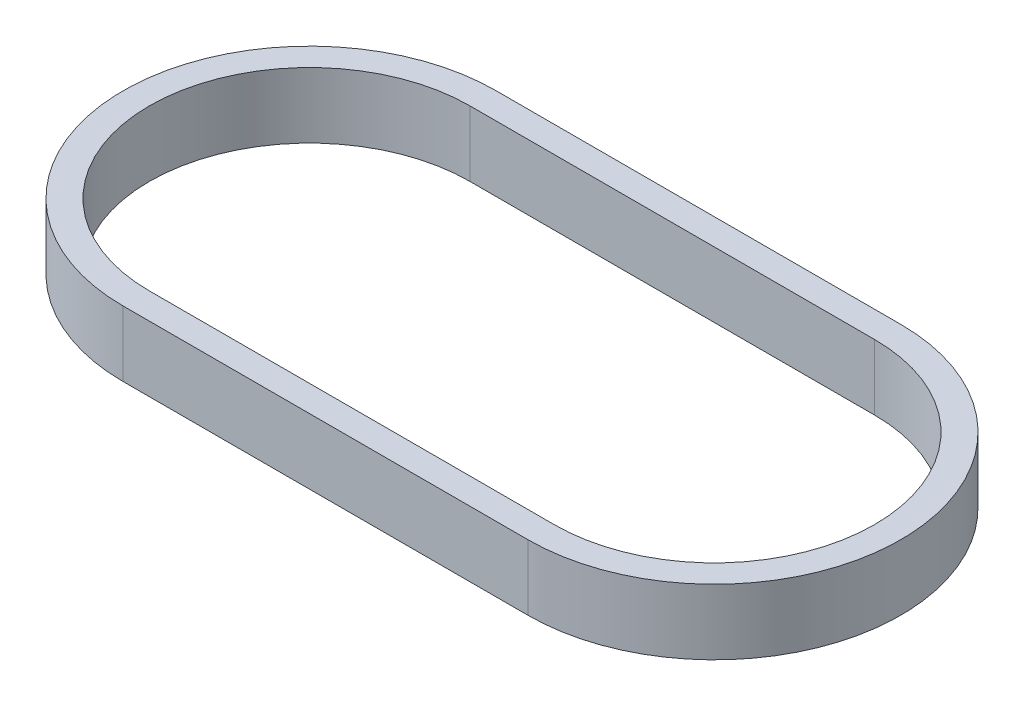
ISO-10303-21;
HEADER;
FILE_DESCRIPTION(('STEP AP214'),'2;1');
FILE_NAME('part.step','',(''),(''),'','','');
FILE_SCHEMA(('AUTOMOTIVE_DESIGN { 1 0 10303 214 1 1 1 1 }'));
ENDSEC;
DATA;
#1=APPLICATION_CONTEXT('core data for automotive mechanical design processes');
#2=APPLICATION_PROTOCOL_DEFINITION('international standard','automotive_design',2000,#1);
#3=PRODUCT_CONTEXT('',#1,'mechanical');
#4=PRODUCT('Part','Part','',(#3));
#5=PRODUCT_RELATED_PRODUCT_CATEGORY('part','',(#4));
#6=PRODUCT_DEFINITION_FORMATION('','',#4);
#7=PRODUCT_DEFINITION_CONTEXT('part definition',#1,'design');
#8=PRODUCT_DEFINITION('design','',#6,#7);
#9=PRODUCT_DEFINITION_SHAPE('','',#8);
#10=(LENGTH_UNIT() NAMED_UNIT(*) SI_UNIT(.MILLI.,.METRE.));
#11=(NAMED_UNIT(*) PLANE_ANGLE_UNIT() SI_UNIT($,.RADIAN.));
#12=(NAMED_UNIT(*) SI_UNIT($,.STERADIAN.) SOLID_ANGLE_UNIT());
#13=UNCERTAINTY_MEASURE_WITH_UNIT(LENGTH_MEASURE(1.E-05),#10,'distance_accuracy_value','');
#14=(GEOMETRIC_REPRESENTATION_CONTEXT(3) GLOBAL_UNCERTAINTY_ASSIGNED_CONTEXT((#13)) GLOBAL_UNIT_ASSIGNED_CONTEXT((#10,
#11,#12)) REPRESENTATION_CONTEXT('',''));
#15=CARTESIAN_POINT('',(0.,0.,0.));
#16=DIRECTION('',(0.,0.,1.));
#17=DIRECTION('',(1.,0.,0.));
#18=AXIS2_PLACEMENT_3D('',#15,#16,#17);
#19=CARTESIAN_POINT('',(0.,12.7,0.));
#20=DIRECTION('',(0.,1.,0.));
#21=DIRECTION('',(0.,0.,1.));
#22=AXIS2_PLACEMENT_3D('',#19,#20,#21);
#23=PLANE('',#22);
#24=CARTESIAN_POINT('',(0.,12.7,0.));
#25=DIRECTION('',(0.,1.,0.));
#26=DIRECTION('',(0.,0.,1.));
#27=AXIS2_PLACEMENT_3D('',#24,#25,#26);
#28=CIRCLE('',#27,36.1721401654458);
#29=CARTESIAN_POINT('',(0.,12.7,-36.1721401654458));
#30=VERTEX_POINT('',#29);
#31=CARTESIAN_POINT('',(0.,12.7,36.1721401654458));
#32=VERTEX_POINT('',#31);
#33=EDGE_CURVE('E137',#30,#32,#28,.T.);
#34=ORIENTED_EDGE('',*,*,#33,.T.);
#35=DIRECTION('',(1.,0.,0.));
#36=VECTOR('',#35,1.);
#37=CARTESIAN_POINT('',(0.,12.7,36.1721401654458));
#38=LINE('',#37,#36);
#39=CARTESIAN_POINT('',(78.5207480370886,12.7,36.1721401654459));
#40=VERTEX_POINT('',#39);
#41=EDGE_CURVE('E140',#32,#40,#38,.T.);
#42=ORIENTED_EDGE('',*,*,#41,.T.);
#43=CARTESIAN_POINT('',(78.5207480370886,12.7,1.04055238728977E-13));
#44=DIRECTION('',(0.,1.,0.));
#45=DIRECTION('',(0.,0.,1.));
#46=AXIS2_PLACEMENT_3D('',#43,#44,#45);
#47=CIRCLE('',#46,36.1721401654458);
#48=CARTESIAN_POINT('',(78.5207480370886,12.7,-36.1721401654458));
#49=VERTEX_POINT('',#48);
#50=EDGE_CURVE('E144',#40,#49,#47,.T.);
#51=ORIENTED_EDGE('',*,*,#50,.T.);
#52=DIRECTION('',(-1.,0.,0.));
#53=VECTOR('',#52,1.);
#54=CARTESIAN_POINT('',(0.,12.7,-36.1721401654458));
#55=LINE('',#54,#53);
#56=EDGE_CURVE('E146',#49,#30,#55,.T.);
#57=ORIENTED_EDGE('',*,*,#56,.T.);
#58=EDGE_LOOP('',(#34,#42,#51,#57));
#59=FACE_BOUND('',#58,.T.);
#60=DIRECTION('',(1.,0.,0.));
#61=VECTOR('',#60,1.);
#62=CARTESIAN_POINT('',(0.,12.7,31.0921401654458));
#63=LINE('',#62,#61);
#64=CARTESIAN_POINT('',(0.,12.7,31.0921401654458));
#65=VERTEX_POINT('',#64);
#66=CARTESIAN_POINT('',(78.5207480370886,12.7,31.0921401654459));
#67=VERTEX_POINT('',#66);
#68=EDGE_CURVE('E108',#65,#67,#63,.T.);
#69=ORIENTED_EDGE('',*,*,#68,.F.);
#70=CARTESIAN_POINT('',(0.,12.7,0.));
#71=DIRECTION('',(0.,1.,0.));
#72=DIRECTION('',(0.,0.,1.));
#73=AXIS2_PLACEMENT_3D('',#70,#71,#72);
#74=CIRCLE('',#73,31.0921401654458);
#75=CARTESIAN_POINT('',(0.,12.7,-31.0921401654458));
#76=VERTEX_POINT('',#75);
#77=EDGE_CURVE('E100',#76,#65,#74,.T.);
#78=ORIENTED_EDGE('',*,*,#77,.F.);
#79=DIRECTION('',(-1.,0.,0.));
#80=VECTOR('',#79,1.);
#81=CARTESIAN_POINT('',(0.,12.7,-31.0921401654458));
#82=LINE('',#81,#80);
#83=CARTESIAN_POINT('',(78.5207480370886,12.7,-31.0921401654458));
#84=VERTEX_POINT('',#83);
#85=EDGE_CURVE('E122',#84,#76,#82,.T.);
#86=ORIENTED_EDGE('',*,*,#85,.F.);
#87=CARTESIAN_POINT('',(78.5207480370886,12.7,1.04055238728977E-13));
#88=DIRECTION('',(0.,1.,0.));
#89=DIRECTION('',(0.,0.,1.));
#90=AXIS2_PLACEMENT_3D('',#87,#88,#89);
#91=CIRCLE('',#90,31.0921401654458);
#92=EDGE_CURVE('E120',#67,#84,#91,.T.);
#93=ORIENTED_EDGE('',*,*,#92,.F.);
#94=EDGE_LOOP('',(#69,#78,#86,#93));
#95=FACE_BOUND('',#94,.T.);
#96=ADVANCED_FACE('F35',(#59,#95),#23,.T.);
#97=CARTESIAN_POINT('',(0.,0.,0.));
#98=DIRECTION('',(0.,1.,0.));
#99=DIRECTION('',(0.,0.,1.));
#100=AXIS2_PLACEMENT_3D('',#97,#98,#99);
#101=PLANE('',#100);
#102=CARTESIAN_POINT('',(0.,0.,0.));
#103=DIRECTION('',(0.,1.,0.));
#104=DIRECTION('',(0.,0.,1.));
#105=AXIS2_PLACEMENT_3D('',#102,#103,#104);
#106=CIRCLE('',#105,36.1721401654458);
#107=CARTESIAN_POINT('',(0.,0.,-36.1721401654458));
#108=VERTEX_POINT('',#107);
#109=CARTESIAN_POINT('',(0.,0.,36.1721401654458));
#110=VERTEX_POINT('',#109);
#111=EDGE_CURVE('E116',#108,#110,#106,.T.);
#112=ORIENTED_EDGE('',*,*,#111,.F.);
#113=DIRECTION('',(-1.,0.,0.));
#114=VECTOR('',#113,1.);
#115=CARTESIAN_POINT('',(0.,0.,-36.1721401654458));
#116=LINE('',#115,#114);
#117=CARTESIAN_POINT('',(78.5207480370886,0.,-36.1721401654458));
#118=VERTEX_POINT('',#117);
#119=EDGE_CURVE('E141',#118,#108,#116,.T.);
#120=ORIENTED_EDGE('',*,*,#119,.F.);
#121=CARTESIAN_POINT('',(78.5207480370886,0.,1.04055238728977E-13));
#122=DIRECTION('',(0.,1.,0.));
#123=DIRECTION('',(0.,0.,1.));
#124=AXIS2_PLACEMENT_3D('',#121,#122,#123);
#125=CIRCLE('',#124,36.1721401654458);
#126=CARTESIAN_POINT('',(78.5207480370886,0.,36.1721401654459));
#127=VERTEX_POINT('',#126);
#128=EDGE_CURVE('E154',#127,#118,#125,.T.);
#129=ORIENTED_EDGE('',*,*,#128,.F.);
#130=DIRECTION('',(1.,0.,0.));
#131=VECTOR('',#130,1.);
#132=CARTESIAN_POINT('',(0.,0.,36.1721401654458));
#133=LINE('',#132,#131);
#134=EDGE_CURVE('E151',#110,#127,#133,.T.);
#135=ORIENTED_EDGE('',*,*,#134,.F.);
#136=EDGE_LOOP('',(#112,#120,#129,#135));
#137=FACE_BOUND('',#136,.T.);
#138=CARTESIAN_POINT('',(0.,0.,0.));
#139=DIRECTION('',(0.,1.,0.));
#140=DIRECTION('',(0.,0.,1.));
#141=AXIS2_PLACEMENT_3D('',#138,#139,#140);
#142=CIRCLE('',#141,31.0921401654458);
#143=CARTESIAN_POINT('',(0.,0.,-31.0921401654458));
#144=VERTEX_POINT('',#143);
#145=CARTESIAN_POINT('',(0.,0.,31.0921401654458));
#146=VERTEX_POINT('',#145);
#147=EDGE_CURVE('E58',#144,#146,#142,.T.);
#148=ORIENTED_EDGE('',*,*,#147,.T.);
#149=DIRECTION('',(1.,0.,0.));
#150=VECTOR('',#149,1.);
#151=CARTESIAN_POINT('',(0.,0.,31.0921401654458));
#152=LINE('',#151,#150);
#153=CARTESIAN_POINT('',(78.5207480370886,0.,31.0921401654459));
#154=VERTEX_POINT('',#153);
#155=EDGE_CURVE('E115',#146,#154,#152,.T.);
#156=ORIENTED_EDGE('',*,*,#155,.T.);
#157=CARTESIAN_POINT('',(78.5207480370886,0.,1.04055238728977E-13));
#158=DIRECTION('',(0.,1.,0.));
#159=DIRECTION('',(0.,0.,1.));
#160=AXIS2_PLACEMENT_3D('',#157,#158,#159);
#161=CIRCLE('',#160,31.0921401654458);
#162=CARTESIAN_POINT('',(78.5207480370886,0.,-31.0921401654458));
#163=VERTEX_POINT('',#162);
#164=EDGE_CURVE('E129',#154,#163,#161,.T.);
#165=ORIENTED_EDGE('',*,*,#164,.T.);
#166=DIRECTION('',(-1.,0.,0.));
#167=VECTOR('',#166,1.);
#168=CARTESIAN_POINT('',(0.,0.,-31.0921401654458));
#169=LINE('',#168,#167);
#170=EDGE_CURVE('E109',#163,#144,#169,.T.);
#171=ORIENTED_EDGE('',*,*,#170,.T.);
#172=EDGE_LOOP('',(#148,#156,#165,#171));
#173=FACE_BOUND('',#172,.T.);
#174=ADVANCED_FACE('F172',(#137,#173),#101,.F.);
#175=CARTESIAN_POINT('',(0.,12.7,0.));
#176=DIRECTION('',(0.,-1.,0.));
#177=DIRECTION('',(0.,0.,-1.));
#178=AXIS2_PLACEMENT_3D('',#175,#176,#177);
#179=CYLINDRICAL_SURFACE('',#178,36.1721401654458);
#180=ORIENTED_EDGE('',*,*,#111,.T.);
#181=DIRECTION('',(0.,-1.,0.));
#182=VECTOR('',#181,1.);
#183=CARTESIAN_POINT('',(0.,12.7,36.1721401654458));
#184=LINE('',#183,#182);
#185=EDGE_CURVE('E11',#32,#110,#184,.T.);
#186=ORIENTED_EDGE('',*,*,#185,.F.);
#187=ORIENTED_EDGE('',*,*,#33,.F.);
#188=DIRECTION('',(0.,-1.,0.));
#189=VECTOR('',#188,1.);
#190=CARTESIAN_POINT('',(0.,12.7,-36.1721401654458));
#191=LINE('',#190,#189);
#192=EDGE_CURVE('E148',#30,#108,#191,.T.);
#193=ORIENTED_EDGE('',*,*,#192,.T.);
#194=EDGE_LOOP('',(#180,#186,#187,#193));
#195=FACE_BOUND('',#194,.T.);
#196=ADVANCED_FACE('F37',(#195),#179,.T.);
#197=CARTESIAN_POINT('',(0.,12.7,36.1721401654458));
#198=DIRECTION('',(0.,0.,-1.));
#199=DIRECTION('',(-1.,0.,0.));
#200=AXIS2_PLACEMENT_3D('',#197,#198,#199);
#201=PLANE('',#200);
#202=ORIENTED_EDGE('',*,*,#134,.T.);
#203=DIRECTION('',(0.,-1.,0.));
#204=VECTOR('',#203,1.);
#205=CARTESIAN_POINT('',(78.5207480370886,12.7,36.1721401654459));
#206=LINE('',#205,#204);
#207=EDGE_CURVE('E43',#40,#127,#206,.T.);
#208=ORIENTED_EDGE('',*,*,#207,.F.);
#209=ORIENTED_EDGE('',*,*,#41,.F.);
#210=ORIENTED_EDGE('',*,*,#185,.T.);
#211=EDGE_LOOP('',(#202,#208,#209,#210));
#212=FACE_BOUND('',#211,.T.);
#213=ADVANCED_FACE('F182',(#212),#201,.F.);
#214=CARTESIAN_POINT('',(78.5207480370886,12.7,1.04055238728977E-13));
#215=DIRECTION('',(0.,-1.,0.));
#216=DIRECTION('',(0.,0.,-1.));
#217=AXIS2_PLACEMENT_3D('',#214,#215,#216);
#218=CYLINDRICAL_SURFACE('',#217,36.1721401654458);
#219=ORIENTED_EDGE('',*,*,#128,.T.);
#220=DIRECTION('',(0.,-1.,0.));
#221=VECTOR('',#220,1.);
#222=CARTESIAN_POINT('',(78.5207480370886,12.7,-36.1721401654458));
#223=LINE('',#222,#221);
#224=EDGE_CURVE('E159',#49,#118,#223,.T.);
#225=ORIENTED_EDGE('',*,*,#224,.F.);
#226=ORIENTED_EDGE('',*,*,#50,.F.);
#227=ORIENTED_EDGE('',*,*,#207,.T.);
#228=EDGE_LOOP('',(#219,#225,#226,#227));
#229=FACE_BOUND('',#228,.T.);
#230=ADVANCED_FACE('F166',(#229),#218,.T.);
#231=CARTESIAN_POINT('',(0.,12.7,-36.1721401654458));
#232=DIRECTION('',(0.,0.,1.));
#233=DIRECTION('',(1.,0.,0.));
#234=AXIS2_PLACEMENT_3D('',#231,#232,#233);
#235=PLANE('',#234);
#236=ORIENTED_EDGE('',*,*,#119,.T.);
#237=ORIENTED_EDGE('',*,*,#192,.F.);
#238=ORIENTED_EDGE('',*,*,#56,.F.);
#239=ORIENTED_EDGE('',*,*,#224,.T.);
#240=EDGE_LOOP('',(#236,#237,#238,#239));
#241=FACE_BOUND('',#240,.T.);
#242=ADVANCED_FACE('F176',(#241),#235,.F.);
#243=CARTESIAN_POINT('',(0.,12.7,0.));
#244=DIRECTION('',(0.,-1.,0.));
#245=DIRECTION('',(0.,0.,-1.));
#246=AXIS2_PLACEMENT_3D('',#243,#244,#245);
#247=CYLINDRICAL_SURFACE('',#246,31.0921401654458);
#248=ORIENTED_EDGE('',*,*,#147,.F.);
#249=DIRECTION('',(0.,-1.,0.));
#250=VECTOR('',#249,1.);
#251=CARTESIAN_POINT('',(0.,12.7,-31.0921401654458));
#252=LINE('',#251,#250);
#253=EDGE_CURVE('E104',#76,#144,#252,.T.);
#254=ORIENTED_EDGE('',*,*,#253,.F.);
#255=ORIENTED_EDGE('',*,*,#77,.T.);
#256=DIRECTION('',(0.,-1.,0.));
#257=VECTOR('',#256,1.);
#258=CARTESIAN_POINT('',(0.,12.7,31.0921401654458));
#259=LINE('',#258,#257);
#260=EDGE_CURVE('E103',#65,#146,#259,.T.);
#261=ORIENTED_EDGE('',*,*,#260,.T.);
#262=EDGE_LOOP('',(#248,#254,#255,#261));
#263=FACE_BOUND('',#262,.T.);
#264=ADVANCED_FACE('F102',(#263),#247,.F.);
#265=CARTESIAN_POINT('',(0.,12.7,31.0921401654458));
#266=DIRECTION('',(0.,0.,-1.));
#267=DIRECTION('',(-1.,0.,0.));
#268=AXIS2_PLACEMENT_3D('',#265,#266,#267);
#269=PLANE('',#268);
#270=ORIENTED_EDGE('',*,*,#155,.F.);
#271=ORIENTED_EDGE('',*,*,#260,.F.);
#272=ORIENTED_EDGE('',*,*,#68,.T.);
#273=DIRECTION('',(0.,-1.,0.));
#274=VECTOR('',#273,1.);
#275=CARTESIAN_POINT('',(78.5207480370886,12.7,31.0921401654459));
#276=LINE('',#275,#274);
#277=EDGE_CURVE('E117',#67,#154,#276,.T.);
#278=ORIENTED_EDGE('',*,*,#277,.T.);
#279=EDGE_LOOP('',(#270,#271,#272,#278));
#280=FACE_BOUND('',#279,.T.);
#281=ADVANCED_FACE('F112',(#280),#269,.T.);
#282=CARTESIAN_POINT('',(78.5207480370886,12.7,1.04055238728977E-13));
#283=DIRECTION('',(0.,-1.,0.));
#284=DIRECTION('',(0.,0.,-1.));
#285=AXIS2_PLACEMENT_3D('',#282,#283,#284);
#286=CYLINDRICAL_SURFACE('',#285,31.0921401654458);
#287=ORIENTED_EDGE('',*,*,#164,.F.);
#288=ORIENTED_EDGE('',*,*,#277,.F.);
#289=ORIENTED_EDGE('',*,*,#92,.T.);
#290=DIRECTION('',(0.,-1.,0.));
#291=VECTOR('',#290,1.);
#292=CARTESIAN_POINT('',(78.5207480370886,12.7,-31.0921401654458));
#293=LINE('',#292,#291);
#294=EDGE_CURVE('E50',#84,#163,#293,.T.);
#295=ORIENTED_EDGE('',*,*,#294,.T.);
#296=EDGE_LOOP('',(#287,#288,#289,#295));
#297=FACE_BOUND('',#296,.T.);
#298=ADVANCED_FACE('F205',(#297),#286,.F.);
#299=CARTESIAN_POINT('',(0.,12.7,-31.0921401654458));
#300=DIRECTION('',(0.,0.,1.));
#301=DIRECTION('',(1.,0.,0.));
#302=AXIS2_PLACEMENT_3D('',#299,#300,#301);
#303=PLANE('',#302);
#304=ORIENTED_EDGE('',*,*,#170,.F.);
#305=ORIENTED_EDGE('',*,*,#294,.F.);
#306=ORIENTED_EDGE('',*,*,#85,.T.);
#307=ORIENTED_EDGE('',*,*,#253,.T.);
#308=EDGE_LOOP('',(#304,#305,#306,#307));
#309=FACE_BOUND('',#308,.T.);
#310=ADVANCED_FACE('F209',(#309),#303,.T.);
#311=CLOSED_SHELL('',(#96,#174,#196,#213,#230,#242,#264,#281,#298,#310));
#312=MANIFOLD_SOLID_BREP('B2',#311);
#313=ADVANCED_BREP_SHAPE_REPRESENTATION('',(#18,#312),#14);
#314=SHAPE_DEFINITION_REPRESENTATION(#9,#313);
ENDSEC;
END-ISO-10303-21;
